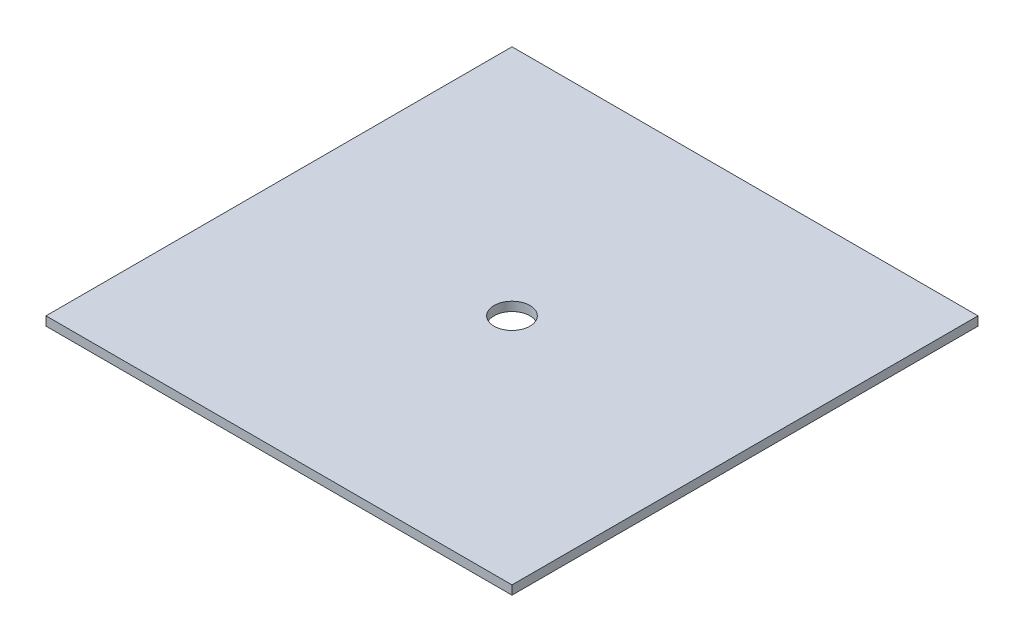
ISO-10303-21;
HEADER;
FILE_DESCRIPTION(('STEP AP214'),'2;1');
FILE_NAME('part.step','',(''),(''),'','','');
FILE_SCHEMA(('AUTOMOTIVE_DESIGN { 1 0 10303 214 1 1 1 1 }'));
ENDSEC;
DATA;
#1=APPLICATION_CONTEXT('core data for automotive mechanical design processes');
#2=APPLICATION_PROTOCOL_DEFINITION('international standard','automotive_design',2000,#1);
#3=PRODUCT_CONTEXT('',#1,'mechanical');
#4=PRODUCT('Part','Part','',(#3));
#5=PRODUCT_RELATED_PRODUCT_CATEGORY('part','',(#4));
#6=PRODUCT_DEFINITION_FORMATION('','',#4);
#7=PRODUCT_DEFINITION_CONTEXT('part definition',#1,'design');
#8=PRODUCT_DEFINITION('design','',#6,#7);
#9=PRODUCT_DEFINITION_SHAPE('','',#8);
#10=(LENGTH_UNIT() NAMED_UNIT(*) SI_UNIT(.MILLI.,.METRE.));
#11=(NAMED_UNIT(*) PLANE_ANGLE_UNIT() SI_UNIT($,.RADIAN.));
#12=(NAMED_UNIT(*) SI_UNIT($,.STERADIAN.) SOLID_ANGLE_UNIT());
#13=UNCERTAINTY_MEASURE_WITH_UNIT(LENGTH_MEASURE(1.E-05),#10,'distance_accuracy_value','');
#14=(GEOMETRIC_REPRESENTATION_CONTEXT(3) GLOBAL_UNCERTAINTY_ASSIGNED_CONTEXT((#13)) GLOBAL_UNIT_ASSIGNED_CONTEXT((#10,
#11,#12)) REPRESENTATION_CONTEXT('',''));
#15=CARTESIAN_POINT('',(0.,0.,0.));
#16=DIRECTION('',(0.,0.,1.));
#17=DIRECTION('',(1.,0.,0.));
#18=AXIS2_PLACEMENT_3D('',#15,#16,#17);
#19=CARTESIAN_POINT('',(-6.5,0.25,6.5));
#20=DIRECTION('',(1.,0.,0.));
#21=DIRECTION('',(0.,0.,-1.));
#22=AXIS2_PLACEMENT_3D('',#19,#20,#21);
#23=PLANE('',#22);
#24=DIRECTION('',(0.,0.,1.));
#25=VECTOR('',#24,1.);
#26=CARTESIAN_POINT('',(-6.5,0.,6.5));
#27=LINE('',#26,#25);
#28=CARTESIAN_POINT('',(-6.5,0.,-6.5));
#29=VERTEX_POINT('',#28);
#30=CARTESIAN_POINT('',(-6.5,0.,6.5));
#31=VERTEX_POINT('',#30);
#32=EDGE_CURVE('E114',#29,#31,#27,.T.);
#33=ORIENTED_EDGE('',*,*,#32,.T.);
#34=DIRECTION('',(0.,-1.,0.));
#35=VECTOR('',#34,1.);
#36=CARTESIAN_POINT('',(-6.5,0.25,6.5));
#37=LINE('',#36,#35);
#38=CARTESIAN_POINT('',(-6.5,0.25,6.5));
#39=VERTEX_POINT('',#38);
#40=EDGE_CURVE('E11',#39,#31,#37,.T.);
#41=ORIENTED_EDGE('',*,*,#40,.F.);
#42=DIRECTION('',(0.,0.,1.));
#43=VECTOR('',#42,1.);
#44=CARTESIAN_POINT('',(-6.5,0.25,6.5));
#45=LINE('',#44,#43);
#46=CARTESIAN_POINT('',(-6.5,0.25,-6.5));
#47=VERTEX_POINT('',#46);
#48=EDGE_CURVE('E97',#47,#39,#45,.T.);
#49=ORIENTED_EDGE('',*,*,#48,.F.);
#50=DIRECTION('',(0.,-1.,0.));
#51=VECTOR('',#50,1.);
#52=CARTESIAN_POINT('',(-6.5,0.25,-6.5));
#53=LINE('',#52,#51);
#54=EDGE_CURVE('E110',#47,#29,#53,.T.);
#55=ORIENTED_EDGE('',*,*,#54,.T.);
#56=EDGE_LOOP('',(#33,#41,#49,#55));
#57=FACE_BOUND('',#56,.T.);
#58=ADVANCED_FACE('F44',(#57),#23,.F.);
#59=CARTESIAN_POINT('',(6.5,0.25,6.5));
#60=DIRECTION('',(0.,0.,-1.));
#61=DIRECTION('',(-1.,0.,0.));
#62=AXIS2_PLACEMENT_3D('',#59,#60,#61);
#63=PLANE('',#62);
#64=DIRECTION('',(1.,0.,0.));
#65=VECTOR('',#64,1.);
#66=CARTESIAN_POINT('',(6.5,0.,6.5));
#67=LINE('',#66,#65);
#68=CARTESIAN_POINT('',(6.5,0.,6.5));
#69=VERTEX_POINT('',#68);
#70=EDGE_CURVE('E102',#31,#69,#67,.T.);
#71=ORIENTED_EDGE('',*,*,#70,.T.);
#72=DIRECTION('',(0.,-1.,0.));
#73=VECTOR('',#72,1.);
#74=CARTESIAN_POINT('',(6.5,0.25,6.5));
#75=LINE('',#74,#73);
#76=CARTESIAN_POINT('',(6.5,0.25,6.5));
#77=VERTEX_POINT('',#76);
#78=EDGE_CURVE('E54',#77,#69,#75,.T.);
#79=ORIENTED_EDGE('',*,*,#78,.F.);
#80=DIRECTION('',(1.,0.,0.));
#81=VECTOR('',#80,1.);
#82=CARTESIAN_POINT('',(6.5,0.25,6.5));
#83=LINE('',#82,#81);
#84=EDGE_CURVE('E92',#39,#77,#83,.T.);
#85=ORIENTED_EDGE('',*,*,#84,.F.);
#86=ORIENTED_EDGE('',*,*,#40,.T.);
#87=EDGE_LOOP('',(#71,#79,#85,#86));
#88=FACE_BOUND('',#87,.T.);
#89=ADVANCED_FACE('F101',(#88),#63,.F.);
#90=CARTESIAN_POINT('',(6.5,0.25,6.5));
#91=DIRECTION('',(-1.,0.,0.));
#92=DIRECTION('',(0.,0.,1.));
#93=AXIS2_PLACEMENT_3D('',#90,#91,#92);
#94=PLANE('',#93);
#95=DIRECTION('',(0.,0.,-1.));
#96=VECTOR('',#95,1.);
#97=CARTESIAN_POINT('',(6.5,0.,6.5));
#98=LINE('',#97,#96);
#99=CARTESIAN_POINT('',(6.5,0.,-6.5));
#100=VERTEX_POINT('',#99);
#101=EDGE_CURVE('E79',#69,#100,#98,.T.);
#102=ORIENTED_EDGE('',*,*,#101,.T.);
#103=DIRECTION('',(0.,-1.,0.));
#104=VECTOR('',#103,1.);
#105=CARTESIAN_POINT('',(6.5,0.25,-6.5));
#106=LINE('',#105,#104);
#107=CARTESIAN_POINT('',(6.5,0.25,-6.5));
#108=VERTEX_POINT('',#107);
#109=EDGE_CURVE('E104',#108,#100,#106,.T.);
#110=ORIENTED_EDGE('',*,*,#109,.F.);
#111=DIRECTION('',(0.,0.,-1.));
#112=VECTOR('',#111,1.);
#113=CARTESIAN_POINT('',(6.5,0.25,6.5));
#114=LINE('',#113,#112);
#115=EDGE_CURVE('E95',#77,#108,#114,.T.);
#116=ORIENTED_EDGE('',*,*,#115,.F.);
#117=ORIENTED_EDGE('',*,*,#78,.T.);
#118=EDGE_LOOP('',(#102,#110,#116,#117));
#119=FACE_BOUND('',#118,.T.);
#120=ADVANCED_FACE('F106',(#119),#94,.F.);
#121=CARTESIAN_POINT('',(6.5,0.25,-6.5));
#122=DIRECTION('',(0.,0.,1.));
#123=DIRECTION('',(1.,0.,0.));
#124=AXIS2_PLACEMENT_3D('',#121,#122,#123);
#125=PLANE('',#124);
#126=DIRECTION('',(-1.,0.,0.));
#127=VECTOR('',#126,1.);
#128=CARTESIAN_POINT('',(6.5,0.,-6.5));
#129=LINE('',#128,#127);
#130=EDGE_CURVE('E85',#100,#29,#129,.T.);
#131=ORIENTED_EDGE('',*,*,#130,.T.);
#132=ORIENTED_EDGE('',*,*,#54,.F.);
#133=DIRECTION('',(-1.,0.,0.));
#134=VECTOR('',#133,1.);
#135=CARTESIAN_POINT('',(6.5,0.25,-6.5));
#136=LINE('',#135,#134);
#137=EDGE_CURVE('E62',#108,#47,#136,.T.);
#138=ORIENTED_EDGE('',*,*,#137,.F.);
#139=ORIENTED_EDGE('',*,*,#109,.T.);
#140=EDGE_LOOP('',(#131,#132,#138,#139));
#141=FACE_BOUND('',#140,.T.);
#142=ADVANCED_FACE('F128',(#141),#125,.F.);
#143=CARTESIAN_POINT('',(0.,0.25,0.));
#144=DIRECTION('',(0.,1.,0.));
#145=DIRECTION('',(0.,0.,1.));
#146=AXIS2_PLACEMENT_3D('',#143,#144,#145);
#147=PLANE('',#146);
#148=CARTESIAN_POINT('',(0.,0.25,0.));
#149=DIRECTION('',(0.,1.,0.));
#150=DIRECTION('',(0.,0.,1.));
#151=AXIS2_PLACEMENT_3D('',#148,#149,#150);
#152=CIRCLE('',#151,0.5);
#153=CARTESIAN_POINT('',(0.,0.25,0.5));
#154=VERTEX_POINT('',#153);
#155=EDGE_CURVE('E118',#154,#154,#152,.F.);
#156=ORIENTED_EDGE('',*,*,#155,.T.);
#157=EDGE_LOOP('',(#156));
#158=FACE_BOUND('',#157,.T.);
#159=ORIENTED_EDGE('',*,*,#48,.T.);
#160=ORIENTED_EDGE('',*,*,#84,.T.);
#161=ORIENTED_EDGE('',*,*,#115,.T.);
#162=ORIENTED_EDGE('',*,*,#137,.T.);
#163=EDGE_LOOP('',(#159,#160,#161,#162));
#164=FACE_BOUND('',#163,.T.);
#165=ADVANCED_FACE('F93',(#158,#164),#147,.T.);
#166=CARTESIAN_POINT('',(0.,0.,0.));
#167=DIRECTION('',(0.,1.,0.));
#168=DIRECTION('',(0.,0.,1.));
#169=AXIS2_PLACEMENT_3D('',#166,#167,#168);
#170=PLANE('',#169);
#171=CARTESIAN_POINT('',(0.,0.,0.));
#172=DIRECTION('',(0.,1.,0.));
#173=DIRECTION('',(0.,0.,1.));
#174=AXIS2_PLACEMENT_3D('',#171,#172,#173);
#175=CIRCLE('',#174,0.5);
#176=CARTESIAN_POINT('',(0.,0.,0.5));
#177=VERTEX_POINT('',#176);
#178=EDGE_CURVE('E47',#177,#177,#175,.F.);
#179=ORIENTED_EDGE('',*,*,#178,.F.);
#180=EDGE_LOOP('',(#179));
#181=FACE_BOUND('',#180,.T.);
#182=ORIENTED_EDGE('',*,*,#32,.F.);
#183=ORIENTED_EDGE('',*,*,#130,.F.);
#184=ORIENTED_EDGE('',*,*,#101,.F.);
#185=ORIENTED_EDGE('',*,*,#70,.F.);
#186=EDGE_LOOP('',(#182,#183,#184,#185));
#187=FACE_BOUND('',#186,.T.);
#188=ADVANCED_FACE('F131',(#181,#187),#170,.F.);
#189=CARTESIAN_POINT('',(0.,10.25,0.));
#190=DIRECTION('',(0.,-1.,0.));
#191=DIRECTION('',(0.,0.,-1.));
#192=AXIS2_PLACEMENT_3D('',#189,#190,#191);
#193=CYLINDRICAL_SURFACE('',#192,0.5);
#194=ORIENTED_EDGE('',*,*,#155,.F.);
#195=EDGE_LOOP('',(#194));
#196=FACE_BOUND('',#195,.T.);
#197=ORIENTED_EDGE('',*,*,#178,.T.);
#198=EDGE_LOOP('',(#197));
#199=FACE_BOUND('',#198,.T.);
#200=ADVANCED_FACE('F143',(#196,#199),#193,.F.);
#201=CLOSED_SHELL('',(#58,#89,#120,#142,#165,#188,#200));
#202=MANIFOLD_SOLID_BREP('B2',#201);
#203=ADVANCED_BREP_SHAPE_REPRESENTATION('',(#18,#202),#14);
#204=SHAPE_DEFINITION_REPRESENTATION(#9,#203);
ENDSEC;
END-ISO-10303-21;
